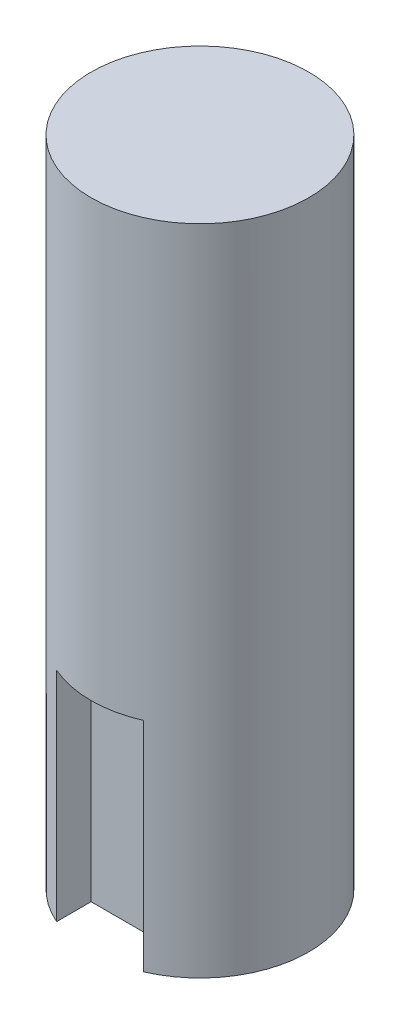
ISO-10303-21;
HEADER;
FILE_DESCRIPTION(('STEP AP214'),'2;1');
FILE_NAME('part.step','',(''),(''),'','','');
FILE_SCHEMA(('AUTOMOTIVE_DESIGN { 1 0 10303 214 1 1 1 1 }'));
ENDSEC;
DATA;
#1=APPLICATION_CONTEXT('core data for automotive mechanical design processes');
#2=APPLICATION_PROTOCOL_DEFINITION('international standard','automotive_design',2000,#1);
#3=PRODUCT_CONTEXT('',#1,'mechanical');
#4=PRODUCT('Part','Part','',(#3));
#5=PRODUCT_RELATED_PRODUCT_CATEGORY('part','',(#4));
#6=PRODUCT_DEFINITION_FORMATION('','',#4);
#7=PRODUCT_DEFINITION_CONTEXT('part definition',#1,'design');
#8=PRODUCT_DEFINITION('design','',#6,#7);
#9=PRODUCT_DEFINITION_SHAPE('','',#8);
#10=(LENGTH_UNIT() NAMED_UNIT(*) SI_UNIT(.MILLI.,.METRE.));
#11=(NAMED_UNIT(*) PLANE_ANGLE_UNIT() SI_UNIT($,.RADIAN.));
#12=(NAMED_UNIT(*) SI_UNIT($,.STERADIAN.) SOLID_ANGLE_UNIT());
#13=UNCERTAINTY_MEASURE_WITH_UNIT(LENGTH_MEASURE(1.E-05),#10,'distance_accuracy_value','');
#14=(GEOMETRIC_REPRESENTATION_CONTEXT(3) GLOBAL_UNCERTAINTY_ASSIGNED_CONTEXT((#13)) GLOBAL_UNIT_ASSIGNED_CONTEXT((#10,
#11,#12)) REPRESENTATION_CONTEXT('',''));
#15=CARTESIAN_POINT('',(0.,0.,0.));
#16=DIRECTION('',(0.,0.,1.));
#17=DIRECTION('',(1.,0.,0.));
#18=AXIS2_PLACEMENT_3D('',#15,#16,#17);
#19=CARTESIAN_POINT('',(0.,30.,0.));
#20=DIRECTION('',(0.,-1.,0.));
#21=DIRECTION('',(0.,0.,-1.));
#22=AXIS2_PLACEMENT_3D('',#19,#20,#21);
#23=CYLINDRICAL_SURFACE('',#22,5.);
#24=CARTESIAN_POINT('',(0.,0.,0.));
#25=DIRECTION('',(0.,1.,0.));
#26=DIRECTION('',(0.,0.,1.));
#27=AXIS2_PLACEMENT_3D('',#24,#25,#26);
#28=CIRCLE('',#27,5.);
#29=CARTESIAN_POINT('',(2.,0.,4.58257569495584));
#30=VERTEX_POINT('',#29);
#31=CARTESIAN_POINT('',(-2.,0.,4.58257569495584));
#32=VERTEX_POINT('',#31);
#33=EDGE_CURVE('E40',#30,#32,#28,.T.);
#34=ORIENTED_EDGE('',*,*,#33,.T.);
#35=DIRECTION('',(0.,-1.,0.));
#36=VECTOR('',#35,1.);
#37=CARTESIAN_POINT('',(-2.,10.,4.58257569495584));
#38=LINE('',#37,#36);
#39=CARTESIAN_POINT('',(-2.,10.,4.58257569495584));
#40=VERTEX_POINT('',#39);
#41=EDGE_CURVE('E72',#40,#32,#38,.T.);
#42=ORIENTED_EDGE('',*,*,#41,.F.);
#43=CARTESIAN_POINT('',(0.,10.,0.));
#44=DIRECTION('',(0.,-1.,0.));
#45=DIRECTION('',(0.,0.,-1.));
#46=AXIS2_PLACEMENT_3D('',#43,#44,#45);
#47=CIRCLE('',#46,5.);
#48=CARTESIAN_POINT('',(2.,10.,4.58257569495584));
#49=VERTEX_POINT('',#48);
#50=EDGE_CURVE('E96',#49,#40,#47,.T.);
#51=ORIENTED_EDGE('',*,*,#50,.F.);
#52=DIRECTION('',(0.,-1.,0.));
#53=VECTOR('',#52,1.);
#54=CARTESIAN_POINT('',(2.,10.,4.58257569495584));
#55=LINE('',#54,#53);
#56=EDGE_CURVE('E88',#49,#30,#55,.T.);
#57=ORIENTED_EDGE('',*,*,#56,.T.);
#58=EDGE_LOOP('',(#34,#42,#51,#57));
#59=FACE_BOUND('',#58,.T.);
#60=CARTESIAN_POINT('',(0.,30.,0.));
#61=DIRECTION('',(0.,1.,0.));
#62=DIRECTION('',(0.,0.,1.));
#63=AXIS2_PLACEMENT_3D('',#60,#61,#62);
#64=CIRCLE('',#63,5.);
#65=CARTESIAN_POINT('',(0.,30.,5.));
#66=VERTEX_POINT('',#65);
#67=EDGE_CURVE('E11',#66,#66,#64,.T.);
#68=ORIENTED_EDGE('',*,*,#67,.F.);
#69=EDGE_LOOP('',(#68));
#70=FACE_BOUND('',#69,.T.);
#71=ADVANCED_FACE('F37',(#59,#70),#23,.T.);
#72=CARTESIAN_POINT('',(0.,30.,0.));
#73=DIRECTION('',(0.,1.,0.));
#74=DIRECTION('',(0.,0.,1.));
#75=AXIS2_PLACEMENT_3D('',#72,#73,#74);
#76=PLANE('',#75);
#77=ORIENTED_EDGE('',*,*,#67,.T.);
#78=EDGE_LOOP('',(#77));
#79=FACE_BOUND('',#78,.T.);
#80=ADVANCED_FACE('F116',(#79),#76,.T.);
#81=CARTESIAN_POINT('',(0.,0.,0.));
#82=DIRECTION('',(0.,1.,0.));
#83=DIRECTION('',(0.,0.,1.));
#84=AXIS2_PLACEMENT_3D('',#81,#82,#83);
#85=PLANE('',#84);
#86=DIRECTION('',(1.,0.,0.));
#87=VECTOR('',#86,1.);
#88=CARTESIAN_POINT('',(-2.,0.,3.));
#89=LINE('',#88,#87);
#90=CARTESIAN_POINT('',(-2.,0.,3.));
#91=VERTEX_POINT('',#90);
#92=CARTESIAN_POINT('',(2.,0.,3.));
#93=VERTEX_POINT('',#92);
#94=EDGE_CURVE('E85',#91,#93,#89,.T.);
#95=ORIENTED_EDGE('',*,*,#94,.F.);
#96=DIRECTION('',(0.,0.,-1.));
#97=VECTOR('',#96,1.);
#98=CARTESIAN_POINT('',(-2.,0.,3.));
#99=LINE('',#98,#97);
#100=EDGE_CURVE('E51',#32,#91,#99,.T.);
#101=ORIENTED_EDGE('',*,*,#100,.F.);
#102=ORIENTED_EDGE('',*,*,#33,.F.);
#103=DIRECTION('',(0.,0.,1.));
#104=VECTOR('',#103,1.);
#105=CARTESIAN_POINT('',(2.,0.,3.));
#106=LINE('',#105,#104);
#107=EDGE_CURVE('E100',#93,#30,#106,.T.);
#108=ORIENTED_EDGE('',*,*,#107,.F.);
#109=EDGE_LOOP('',(#95,#101,#102,#108));
#110=FACE_BOUND('',#109,.T.);
#111=ADVANCED_FACE('F110',(#110),#85,.F.);
#112=CARTESIAN_POINT('',(-2.,10.,3.));
#113=DIRECTION('',(-1.,0.,0.));
#114=DIRECTION('',(0.,0.,1.));
#115=AXIS2_PLACEMENT_3D('',#112,#113,#114);
#116=PLANE('',#115);
#117=ORIENTED_EDGE('',*,*,#100,.T.);
#118=DIRECTION('',(0.,-1.,0.));
#119=VECTOR('',#118,1.);
#120=CARTESIAN_POINT('',(-2.,10.,3.));
#121=LINE('',#120,#119);
#122=CARTESIAN_POINT('',(-2.,10.,3.));
#123=VERTEX_POINT('',#122);
#124=EDGE_CURVE('E74',#123,#91,#121,.T.);
#125=ORIENTED_EDGE('',*,*,#124,.F.);
#126=DIRECTION('',(0.,0.,-1.));
#127=VECTOR('',#126,1.);
#128=CARTESIAN_POINT('',(-2.,10.,3.));
#129=LINE('',#128,#127);
#130=EDGE_CURVE('E57',#40,#123,#129,.T.);
#131=ORIENTED_EDGE('',*,*,#130,.F.);
#132=ORIENTED_EDGE('',*,*,#41,.T.);
#133=EDGE_LOOP('',(#117,#125,#131,#132));
#134=FACE_BOUND('',#133,.T.);
#135=ADVANCED_FACE('F124',(#134),#116,.F.);
#136=CARTESIAN_POINT('',(2.,10.,3.));
#137=DIRECTION('',(1.,0.,0.));
#138=DIRECTION('',(0.,0.,-1.));
#139=AXIS2_PLACEMENT_3D('',#136,#137,#138);
#140=PLANE('',#139);
#141=ORIENTED_EDGE('',*,*,#107,.T.);
#142=ORIENTED_EDGE('',*,*,#56,.F.);
#143=DIRECTION('',(0.,0.,1.));
#144=VECTOR('',#143,1.);
#145=CARTESIAN_POINT('',(2.,10.,3.));
#146=LINE('',#145,#144);
#147=CARTESIAN_POINT('',(2.,10.,3.));
#148=VERTEX_POINT('',#147);
#149=EDGE_CURVE('E91',#148,#49,#146,.T.);
#150=ORIENTED_EDGE('',*,*,#149,.F.);
#151=DIRECTION('',(0.,-1.,0.));
#152=VECTOR('',#151,1.);
#153=CARTESIAN_POINT('',(2.,10.,3.));
#154=LINE('',#153,#152);
#155=EDGE_CURVE('E79',#148,#93,#154,.T.);
#156=ORIENTED_EDGE('',*,*,#155,.T.);
#157=EDGE_LOOP('',(#141,#142,#150,#156));
#158=FACE_BOUND('',#157,.T.);
#159=ADVANCED_FACE('F92',(#158),#140,.F.);
#160=CARTESIAN_POINT('',(-2.,10.,3.));
#161=DIRECTION('',(0.,0.,-1.));
#162=DIRECTION('',(-1.,0.,0.));
#163=AXIS2_PLACEMENT_3D('',#160,#161,#162);
#164=PLANE('',#163);
#165=ORIENTED_EDGE('',*,*,#94,.T.);
#166=ORIENTED_EDGE('',*,*,#155,.F.);
#167=DIRECTION('',(1.,0.,0.));
#168=VECTOR('',#167,1.);
#169=CARTESIAN_POINT('',(-2.,10.,3.));
#170=LINE('',#169,#168);
#171=EDGE_CURVE('E83',#123,#148,#170,.T.);
#172=ORIENTED_EDGE('',*,*,#171,.F.);
#173=ORIENTED_EDGE('',*,*,#124,.T.);
#174=EDGE_LOOP('',(#165,#166,#172,#173));
#175=FACE_BOUND('',#174,.T.);
#176=ADVANCED_FACE('F81',(#175),#164,.F.);
#177=CARTESIAN_POINT('',(0.,10.,0.));
#178=DIRECTION('',(0.,-1.,0.));
#179=DIRECTION('',(0.,0.,-1.));
#180=AXIS2_PLACEMENT_3D('',#177,#178,#179);
#181=PLANE('',#180);
#182=ORIENTED_EDGE('',*,*,#130,.T.);
#183=ORIENTED_EDGE('',*,*,#171,.T.);
#184=ORIENTED_EDGE('',*,*,#149,.T.);
#185=ORIENTED_EDGE('',*,*,#50,.T.);
#186=EDGE_LOOP('',(#182,#183,#184,#185));
#187=FACE_BOUND('',#186,.T.);
#188=ADVANCED_FACE('F98',(#187),#181,.T.);
#189=CLOSED_SHELL('',(#71,#80,#111,#135,#159,#176,#188));
#190=MANIFOLD_SOLID_BREP('B2',#189);
#191=ADVANCED_BREP_SHAPE_REPRESENTATION('',(#18,#190),#14);
#192=SHAPE_DEFINITION_REPRESENTATION(#9,#191);
ENDSEC;
END-ISO-10303-21;
